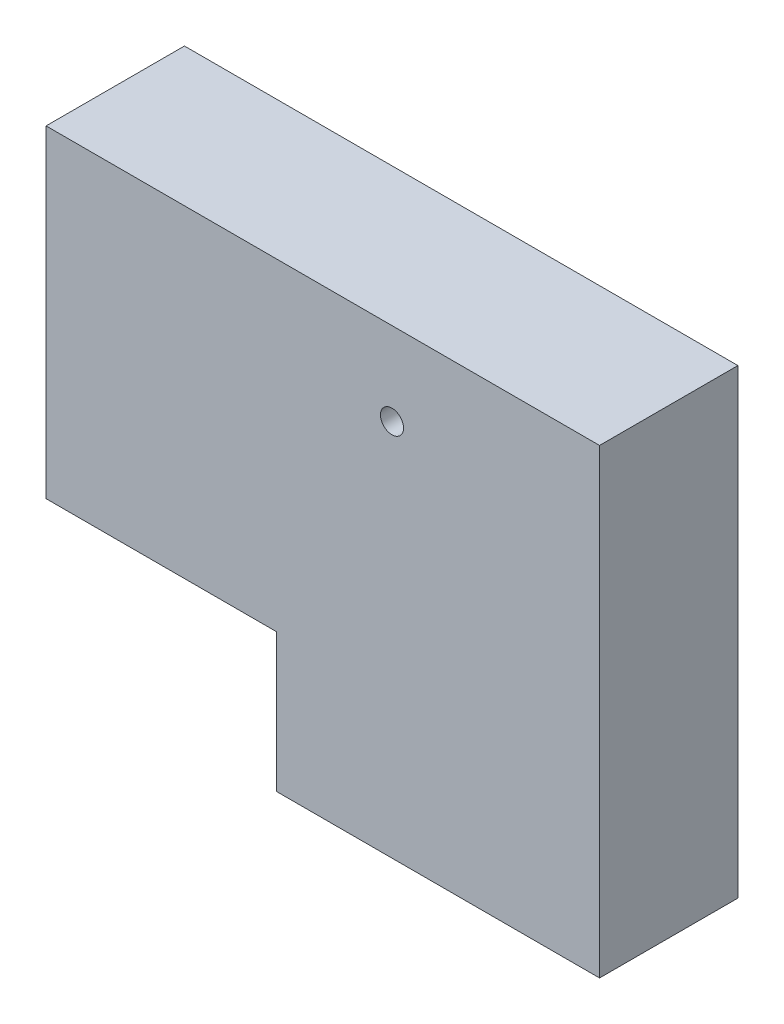
ISO-10303-21;
HEADER;
FILE_DESCRIPTION(('STEP AP214'),'2;1');
FILE_NAME('part.step','',(''),(''),'','','');
FILE_SCHEMA(('AUTOMOTIVE_DESIGN { 1 0 10303 214 1 1 1 1 }'));
ENDSEC;
DATA;
#1=APPLICATION_CONTEXT('core data for automotive mechanical design processes');
#2=APPLICATION_PROTOCOL_DEFINITION('international standard','automotive_design',2000,#1);
#3=PRODUCT_CONTEXT('',#1,'mechanical');
#4=PRODUCT('Part','Part','',(#3));
#5=PRODUCT_RELATED_PRODUCT_CATEGORY('part','',(#4));
#6=PRODUCT_DEFINITION_FORMATION('','',#4);
#7=PRODUCT_DEFINITION_CONTEXT('part definition',#1,'design');
#8=PRODUCT_DEFINITION('design','',#6,#7);
#9=PRODUCT_DEFINITION_SHAPE('','',#8);
#10=(LENGTH_UNIT() NAMED_UNIT(*) SI_UNIT(.MILLI.,.METRE.));
#11=(NAMED_UNIT(*) PLANE_ANGLE_UNIT() SI_UNIT($,.RADIAN.));
#12=(NAMED_UNIT(*) SI_UNIT($,.STERADIAN.) SOLID_ANGLE_UNIT());
#13=UNCERTAINTY_MEASURE_WITH_UNIT(LENGTH_MEASURE(1.E-05),#10,'distance_accuracy_value','');
#14=(GEOMETRIC_REPRESENTATION_CONTEXT(3) GLOBAL_UNCERTAINTY_ASSIGNED_CONTEXT((#13)) GLOBAL_UNIT_ASSIGNED_CONTEXT((#10,
#11,#12)) REPRESENTATION_CONTEXT('',''));
#15=CARTESIAN_POINT('',(0.,0.,0.));
#16=DIRECTION('',(0.,0.,1.));
#17=DIRECTION('',(1.,0.,0.));
#18=AXIS2_PLACEMENT_3D('',#15,#16,#17);
#19=CARTESIAN_POINT('',(-120.,0.,30.));
#20=DIRECTION('',(1.,0.,0.));
#21=DIRECTION('',(0.,1.,0.));
#22=AXIS2_PLACEMENT_3D('',#19,#20,#21);
#23=PLANE('',#22);
#24=DIRECTION('',(0.,-1.,0.));
#25=VECTOR('',#24,1.);
#26=CARTESIAN_POINT('',(-120.,0.,0.));
#27=LINE('',#26,#25);
#28=CARTESIAN_POINT('',(-120.,0.,0.));
#29=VERTEX_POINT('',#28);
#30=CARTESIAN_POINT('',(-120.,-70.,0.));
#31=VERTEX_POINT('',#30);
#32=EDGE_CURVE('E124',#29,#31,#27,.T.);
#33=ORIENTED_EDGE('',*,*,#32,.T.);
#34=DIRECTION('',(0.,0.,-1.));
#35=VECTOR('',#34,1.);
#36=CARTESIAN_POINT('',(-120.,-70.,30.));
#37=LINE('',#36,#35);
#38=CARTESIAN_POINT('',(-120.,-70.,30.));
#39=VERTEX_POINT('',#38);
#40=EDGE_CURVE('E11',#39,#31,#37,.T.);
#41=ORIENTED_EDGE('',*,*,#40,.F.);
#42=DIRECTION('',(0.,-1.,0.));
#43=VECTOR('',#42,1.);
#44=CARTESIAN_POINT('',(-120.,0.,30.));
#45=LINE('',#44,#43);
#46=CARTESIAN_POINT('',(-120.,0.,30.));
#47=VERTEX_POINT('',#46);
#48=EDGE_CURVE('E135',#47,#39,#45,.T.);
#49=ORIENTED_EDGE('',*,*,#48,.F.);
#50=DIRECTION('',(0.,0.,-1.));
#51=VECTOR('',#50,1.);
#52=CARTESIAN_POINT('',(-120.,0.,30.));
#53=LINE('',#52,#51);
#54=EDGE_CURVE('E120',#47,#29,#53,.T.);
#55=ORIENTED_EDGE('',*,*,#54,.T.);
#56=EDGE_LOOP('',(#33,#41,#49,#55));
#57=FACE_BOUND('',#56,.T.);
#58=ADVANCED_FACE('F38',(#57),#23,.F.);
#59=CARTESIAN_POINT('',(-120.,-70.,30.));
#60=DIRECTION('',(0.,1.,0.));
#61=DIRECTION('',(0.,0.,1.));
#62=AXIS2_PLACEMENT_3D('',#59,#60,#61);
#63=PLANE('',#62);
#64=DIRECTION('',(1.,0.,0.));
#65=VECTOR('',#64,1.);
#66=CARTESIAN_POINT('',(-120.,-70.,0.));
#67=LINE('',#66,#65);
#68=CARTESIAN_POINT('',(-70.,-70.,0.));
#69=VERTEX_POINT('',#68);
#70=EDGE_CURVE('E127',#31,#69,#67,.T.);
#71=ORIENTED_EDGE('',*,*,#70,.T.);
#72=DIRECTION('',(0.,0.,-1.));
#73=VECTOR('',#72,1.);
#74=CARTESIAN_POINT('',(-70.,-70.,30.));
#75=LINE('',#74,#73);
#76=CARTESIAN_POINT('',(-70.,-70.,30.));
#77=VERTEX_POINT('',#76);
#78=EDGE_CURVE('E46',#77,#69,#75,.T.);
#79=ORIENTED_EDGE('',*,*,#78,.F.);
#80=DIRECTION('',(1.,0.,0.));
#81=VECTOR('',#80,1.);
#82=CARTESIAN_POINT('',(-120.,-70.,30.));
#83=LINE('',#82,#81);
#84=EDGE_CURVE('E92',#39,#77,#83,.T.);
#85=ORIENTED_EDGE('',*,*,#84,.F.);
#86=ORIENTED_EDGE('',*,*,#40,.T.);
#87=EDGE_LOOP('',(#71,#79,#85,#86));
#88=FACE_BOUND('',#87,.T.);
#89=ADVANCED_FACE('F160',(#88),#63,.F.);
#90=CARTESIAN_POINT('',(-70.,-70.,30.));
#91=DIRECTION('',(1.,0.,0.));
#92=DIRECTION('',(0.,0.,-1.));
#93=AXIS2_PLACEMENT_3D('',#90,#91,#92);
#94=PLANE('',#93);
#95=DIRECTION('',(0.,-1.,0.));
#96=VECTOR('',#95,1.);
#97=CARTESIAN_POINT('',(-70.,-70.,0.));
#98=LINE('',#97,#96);
#99=CARTESIAN_POINT('',(-70.,-100.,0.));
#100=VERTEX_POINT('',#99);
#101=EDGE_CURVE('E130',#69,#100,#98,.T.);
#102=ORIENTED_EDGE('',*,*,#101,.T.);
#103=DIRECTION('',(0.,0.,-1.));
#104=VECTOR('',#103,1.);
#105=CARTESIAN_POINT('',(-70.,-100.,30.));
#106=LINE('',#105,#104);
#107=CARTESIAN_POINT('',(-70.,-100.,30.));
#108=VERTEX_POINT('',#107);
#109=EDGE_CURVE('E115',#108,#100,#106,.T.);
#110=ORIENTED_EDGE('',*,*,#109,.F.);
#111=DIRECTION('',(0.,-1.,0.));
#112=VECTOR('',#111,1.);
#113=CARTESIAN_POINT('',(-70.,-70.,30.));
#114=LINE('',#113,#112);
#115=EDGE_CURVE('E106',#77,#108,#114,.T.);
#116=ORIENTED_EDGE('',*,*,#115,.F.);
#117=ORIENTED_EDGE('',*,*,#78,.T.);
#118=EDGE_LOOP('',(#102,#110,#116,#117));
#119=FACE_BOUND('',#118,.T.);
#120=ADVANCED_FACE('F141',(#119),#94,.F.);
#121=CARTESIAN_POINT('',(-70.,-100.,30.));
#122=DIRECTION('',(0.,1.,0.));
#123=DIRECTION('',(0.,0.,1.));
#124=AXIS2_PLACEMENT_3D('',#121,#122,#123);
#125=PLANE('',#124);
#126=DIRECTION('',(1.,0.,0.));
#127=VECTOR('',#126,1.);
#128=CARTESIAN_POINT('',(-70.,-100.,0.));
#129=LINE('',#128,#127);
#130=CARTESIAN_POINT('',(0.,-100.,0.));
#131=VERTEX_POINT('',#130);
#132=EDGE_CURVE('E114',#100,#131,#129,.T.);
#133=ORIENTED_EDGE('',*,*,#132,.T.);
#134=DIRECTION('',(0.,0.,-1.));
#135=VECTOR('',#134,1.);
#136=CARTESIAN_POINT('',(0.,-100.,30.));
#137=LINE('',#136,#135);
#138=CARTESIAN_POINT('',(0.,-100.,30.));
#139=VERTEX_POINT('',#138);
#140=EDGE_CURVE('E111',#139,#131,#137,.T.);
#141=ORIENTED_EDGE('',*,*,#140,.F.);
#142=DIRECTION('',(1.,0.,0.));
#143=VECTOR('',#142,1.);
#144=CARTESIAN_POINT('',(-70.,-100.,30.));
#145=LINE('',#144,#143);
#146=EDGE_CURVE('E100',#108,#139,#145,.T.);
#147=ORIENTED_EDGE('',*,*,#146,.F.);
#148=ORIENTED_EDGE('',*,*,#109,.T.);
#149=EDGE_LOOP('',(#133,#141,#147,#148));
#150=FACE_BOUND('',#149,.T.);
#151=ADVANCED_FACE('F112',(#150),#125,.F.);
#152=CARTESIAN_POINT('',(0.,0.,30.));
#153=DIRECTION('',(-1.,0.,0.));
#154=DIRECTION('',(0.,-1.,0.));
#155=AXIS2_PLACEMENT_3D('',#152,#153,#154);
#156=PLANE('',#155);
#157=DIRECTION('',(0.,1.,0.));
#158=VECTOR('',#157,1.);
#159=CARTESIAN_POINT('',(0.,0.,0.));
#160=LINE('',#159,#158);
#161=CARTESIAN_POINT('',(0.,0.,0.));
#162=VERTEX_POINT('',#161);
#163=EDGE_CURVE('E78',#131,#162,#160,.T.);
#164=ORIENTED_EDGE('',*,*,#163,.T.);
#165=DIRECTION('',(0.,0.,-1.));
#166=VECTOR('',#165,1.);
#167=CARTESIAN_POINT('',(0.,0.,30.));
#168=LINE('',#167,#166);
#169=CARTESIAN_POINT('',(0.,0.,30.));
#170=VERTEX_POINT('',#169);
#171=EDGE_CURVE('E116',#170,#162,#168,.T.);
#172=ORIENTED_EDGE('',*,*,#171,.F.);
#173=DIRECTION('',(0.,1.,0.));
#174=VECTOR('',#173,1.);
#175=CARTESIAN_POINT('',(0.,0.,30.));
#176=LINE('',#175,#174);
#177=EDGE_CURVE('E104',#139,#170,#176,.T.);
#178=ORIENTED_EDGE('',*,*,#177,.F.);
#179=ORIENTED_EDGE('',*,*,#140,.T.);
#180=EDGE_LOOP('',(#164,#172,#178,#179));
#181=FACE_BOUND('',#180,.T.);
#182=ADVANCED_FACE('F118',(#181),#156,.F.);
#183=CARTESIAN_POINT('',(-120.,0.,30.));
#184=DIRECTION('',(0.,-1.,0.));
#185=DIRECTION('',(0.,0.,-1.));
#186=AXIS2_PLACEMENT_3D('',#183,#184,#185);
#187=PLANE('',#186);
#188=DIRECTION('',(-1.,0.,0.));
#189=VECTOR('',#188,1.);
#190=CARTESIAN_POINT('',(-120.,0.,0.));
#191=LINE('',#190,#189);
#192=EDGE_CURVE('E84',#162,#29,#191,.T.);
#193=ORIENTED_EDGE('',*,*,#192,.T.);
#194=ORIENTED_EDGE('',*,*,#54,.F.);
#195=DIRECTION('',(-1.,0.,0.));
#196=VECTOR('',#195,1.);
#197=CARTESIAN_POINT('',(-120.,0.,30.));
#198=LINE('',#197,#196);
#199=EDGE_CURVE('E54',#170,#47,#198,.T.);
#200=ORIENTED_EDGE('',*,*,#199,.F.);
#201=ORIENTED_EDGE('',*,*,#171,.T.);
#202=EDGE_LOOP('',(#193,#194,#200,#201));
#203=FACE_BOUND('',#202,.T.);
#204=ADVANCED_FACE('F148',(#203),#187,.F.);
#205=CARTESIAN_POINT('',(0.,0.,30.));
#206=DIRECTION('',(0.,0.,1.));
#207=DIRECTION('',(1.,0.,0.));
#208=AXIS2_PLACEMENT_3D('',#205,#206,#207);
#209=PLANE('',#208);
#210=CARTESIAN_POINT('',(-45.,-18.,30.));
#211=DIRECTION('',(0.,0.,1.));
#212=DIRECTION('',(1.,0.,0.));
#213=AXIS2_PLACEMENT_3D('',#210,#211,#212);
#214=CIRCLE('',#213,2.5);
#215=CARTESIAN_POINT('',(-42.5,-18.,30.));
#216=VERTEX_POINT('',#215);
#217=EDGE_CURVE('E228',#216,#216,#214,.T.);
#218=ORIENTED_EDGE('',*,*,#217,.F.);
#219=EDGE_LOOP('',(#218));
#220=FACE_BOUND('',#219,.T.);
#221=ORIENTED_EDGE('',*,*,#48,.T.);
#222=ORIENTED_EDGE('',*,*,#84,.T.);
#223=ORIENTED_EDGE('',*,*,#115,.T.);
#224=ORIENTED_EDGE('',*,*,#146,.T.);
#225=ORIENTED_EDGE('',*,*,#177,.T.);
#226=ORIENTED_EDGE('',*,*,#199,.T.);
#227=EDGE_LOOP('',(#221,#222,#223,#224,#225,#226));
#228=FACE_BOUND('',#227,.T.);
#229=ADVANCED_FACE('F102',(#220,#228),#209,.T.);
#230=CARTESIAN_POINT('',(0.,0.,0.));
#231=DIRECTION('',(0.,0.,1.));
#232=DIRECTION('',(1.,0.,0.));
#233=AXIS2_PLACEMENT_3D('',#230,#231,#232);
#234=PLANE('',#233);
#235=ORIENTED_EDGE('',*,*,#32,.F.);
#236=ORIENTED_EDGE('',*,*,#192,.F.);
#237=ORIENTED_EDGE('',*,*,#163,.F.);
#238=ORIENTED_EDGE('',*,*,#132,.F.);
#239=ORIENTED_EDGE('',*,*,#101,.F.);
#240=ORIENTED_EDGE('',*,*,#70,.F.);
#241=EDGE_LOOP('',(#235,#236,#237,#238,#239,#240));
#242=FACE_BOUND('',#241,.T.);
#243=ADVANCED_FACE('F144',(#242),#234,.F.);
#244=CARTESIAN_POINT('',(-45.,-18.,21.));
#245=DIRECTION('',(0.,0.,1.));
#246=DIRECTION('',(1.,0.,0.));
#247=AXIS2_PLACEMENT_3D('',#244,#245,#246);
#248=CONICAL_SURFACE('',#247,2.5,1.02974425867665);
#249=CARTESIAN_POINT('',(-45.,-18.,19.4978484524311));
#250=VERTEX_POINT('',#249);
#251=VERTEX_LOOP('',#250);
#252=FACE_BOUND('',#251,.T.);
#253=CARTESIAN_POINT('',(-45.,-18.,21.));
#254=DIRECTION('',(0.,0.,1.));
#255=DIRECTION('',(1.,0.,0.));
#256=AXIS2_PLACEMENT_3D('',#253,#254,#255);
#257=CIRCLE('',#256,2.5);
#258=CARTESIAN_POINT('',(-42.5,-18.,21.));
#259=VERTEX_POINT('',#258);
#260=EDGE_CURVE('E128',#259,#259,#257,.T.);
#261=ORIENTED_EDGE('',*,*,#260,.T.);
#262=EDGE_LOOP('',(#261));
#263=FACE_BOUND('',#262,.T.);
#264=ADVANCED_FACE('F192',(#252,#263),#248,.F.);
#265=CARTESIAN_POINT('',(-45.,-18.,30.));
#266=DIRECTION('',(0.,0.,1.));
#267=DIRECTION('',(1.,0.,0.));
#268=AXIS2_PLACEMENT_3D('',#265,#266,#267);
#269=CYLINDRICAL_SURFACE('',#268,2.5);
#270=ORIENTED_EDGE('',*,*,#260,.F.);
#271=EDGE_LOOP('',(#270));
#272=FACE_BOUND('',#271,.T.);
#273=ORIENTED_EDGE('',*,*,#217,.T.);
#274=EDGE_LOOP('',(#273));
#275=FACE_BOUND('',#274,.T.);
#276=ADVANCED_FACE('F205',(#272,#275),#269,.F.);
#277=CLOSED_SHELL('',(#58,#89,#120,#151,#182,#204,#229,#243,#264,#276));
#278=MANIFOLD_SOLID_BREP('B2',#277);
#279=ADVANCED_BREP_SHAPE_REPRESENTATION('',(#18,#278),#14);
#280=SHAPE_DEFINITION_REPRESENTATION(#9,#279);
ENDSEC;
END-ISO-10303-21;
